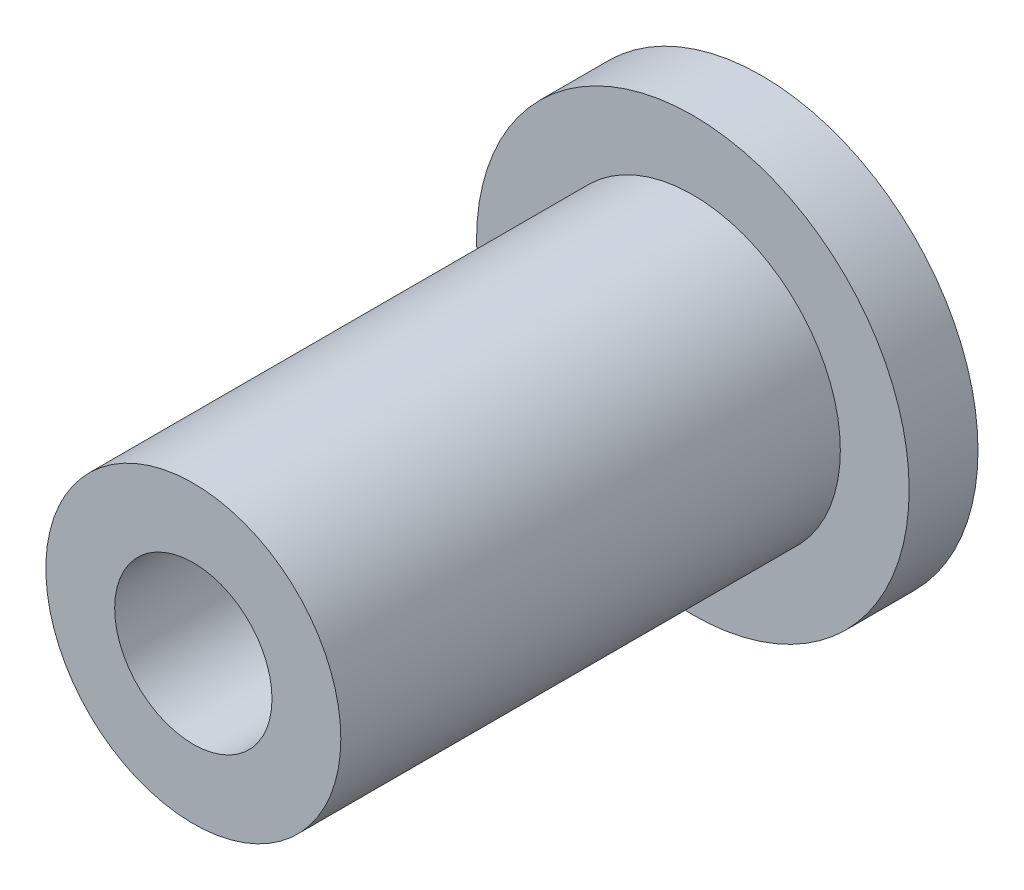
ISO-10303-21;
HEADER;
FILE_DESCRIPTION(('STEP AP214'),'2;1');
FILE_NAME('part.step','',(''),(''),'','','');
FILE_SCHEMA(('AUTOMOTIVE_DESIGN { 1 0 10303 214 1 1 1 1 }'));
ENDSEC;
DATA;
#1=APPLICATION_CONTEXT('core data for automotive mechanical design processes');
#2=APPLICATION_PROTOCOL_DEFINITION('international standard','automotive_design',2000,#1);
#3=PRODUCT_CONTEXT('',#1,'mechanical');
#4=PRODUCT('Part','Part','',(#3));
#5=PRODUCT_RELATED_PRODUCT_CATEGORY('part','',(#4));
#6=PRODUCT_DEFINITION_FORMATION('','',#4);
#7=PRODUCT_DEFINITION_CONTEXT('part definition',#1,'design');
#8=PRODUCT_DEFINITION('design','',#6,#7);
#9=PRODUCT_DEFINITION_SHAPE('','',#8);
#10=(LENGTH_UNIT() NAMED_UNIT(*) SI_UNIT(.MILLI.,.METRE.));
#11=(NAMED_UNIT(*) PLANE_ANGLE_UNIT() SI_UNIT($,.RADIAN.));
#12=(NAMED_UNIT(*) SI_UNIT($,.STERADIAN.) SOLID_ANGLE_UNIT());
#13=UNCERTAINTY_MEASURE_WITH_UNIT(LENGTH_MEASURE(1.E-05),#10,'distance_accuracy_value','');
#14=(GEOMETRIC_REPRESENTATION_CONTEXT(3) GLOBAL_UNCERTAINTY_ASSIGNED_CONTEXT((#13)) GLOBAL_UNIT_ASSIGNED_CONTEXT((#10,
#11,#12)) REPRESENTATION_CONTEXT('',''));
#15=CARTESIAN_POINT('',(0.,0.,0.));
#16=DIRECTION('',(0.,0.,1.));
#17=DIRECTION('',(1.,0.,0.));
#18=AXIS2_PLACEMENT_3D('',#15,#16,#17);
#19=CARTESIAN_POINT('',(0.,0.,12.7));
#20=DIRECTION('',(0.,0.,1.));
#21=DIRECTION('',(1.,0.,0.));
#22=AXIS2_PLACEMENT_3D('',#19,#20,#21);
#23=PLANE('',#22);
#24=CARTESIAN_POINT('',(0.,0.,12.7));
#25=DIRECTION('',(0.,0.,1.));
#26=DIRECTION('',(1.,0.,0.));
#27=AXIS2_PLACEMENT_3D('',#24,#25,#26);
#28=CIRCLE('',#27,7.5);
#29=CARTESIAN_POINT('',(7.5,0.,12.7));
#30=VERTEX_POINT('',#29);
#31=EDGE_CURVE('E10',#30,#30,#28,.T.);
#32=ORIENTED_EDGE('',*,*,#31,.T.);
#33=EDGE_LOOP('',(#32));
#34=FACE_BOUND('',#33,.T.);
#35=CARTESIAN_POINT('',(0.,0.,12.7));
#36=DIRECTION('',(0.,0.,1.));
#37=DIRECTION('',(1.,0.,0.));
#38=AXIS2_PLACEMENT_3D('',#35,#36,#37);
#39=CIRCLE('',#38,4.);
#40=CARTESIAN_POINT('',(4.,0.,12.7));
#41=VERTEX_POINT('',#40);
#42=EDGE_CURVE('E48',#41,#41,#39,.T.);
#43=ORIENTED_EDGE('',*,*,#42,.F.);
#44=EDGE_LOOP('',(#43));
#45=FACE_BOUND('',#44,.T.);
#46=ADVANCED_FACE('F40',(#34,#45),#23,.T.);
#47=CARTESIAN_POINT('',(0.,0.,12.7));
#48=DIRECTION('',(0.,0.,-1.));
#49=DIRECTION('',(-1.,0.,0.));
#50=AXIS2_PLACEMENT_3D('',#47,#48,#49);
#51=CYLINDRICAL_SURFACE('',#50,7.5);
#52=ORIENTED_EDGE('',*,*,#31,.F.);
#53=EDGE_LOOP('',(#52));
#54=FACE_BOUND('',#53,.T.);
#55=CARTESIAN_POINT('',(0.,0.,-12.7));
#56=DIRECTION('',(0.,0.,1.));
#57=DIRECTION('',(1.,0.,0.));
#58=AXIS2_PLACEMENT_3D('',#55,#56,#57);
#59=CIRCLE('',#58,7.5);
#60=CARTESIAN_POINT('',(7.5,0.,-12.7));
#61=VERTEX_POINT('',#60);
#62=EDGE_CURVE('E44',#61,#61,#59,.T.);
#63=ORIENTED_EDGE('',*,*,#62,.T.);
#64=EDGE_LOOP('',(#63));
#65=FACE_BOUND('',#64,.T.);
#66=ADVANCED_FACE('F42',(#54,#65),#51,.T.);
#67=CARTESIAN_POINT('',(0.,0.,12.7));
#68=DIRECTION('',(0.,0.,-1.));
#69=DIRECTION('',(-1.,0.,0.));
#70=AXIS2_PLACEMENT_3D('',#67,#68,#69);
#71=CYLINDRICAL_SURFACE('',#70,4.);
#72=ORIENTED_EDGE('',*,*,#42,.T.);
#73=EDGE_LOOP('',(#72));
#74=FACE_BOUND('',#73,.T.);
#75=CARTESIAN_POINT('',(0.,0.,-16.2));
#76=DIRECTION('',(0.,0.,-1.));
#77=DIRECTION('',(-1.,0.,0.));
#78=AXIS2_PLACEMENT_3D('',#75,#76,#77);
#79=CIRCLE('',#78,4.);
#80=CARTESIAN_POINT('',(-4.,0.,-16.2));
#81=VERTEX_POINT('',#80);
#82=EDGE_CURVE('E60',#81,#81,#79,.T.);
#83=ORIENTED_EDGE('',*,*,#82,.T.);
#84=EDGE_LOOP('',(#83));
#85=FACE_BOUND('',#84,.T.);
#86=ADVANCED_FACE('F64',(#74,#85),#71,.F.);
#87=CARTESIAN_POINT('',(-11.,0.,-12.7));
#88=DIRECTION('',(0.,0.,1.));
#89=DIRECTION('',(1.,0.,0.));
#90=AXIS2_PLACEMENT_3D('',#87,#88,#89);
#91=PLANE('',#90);
#92=ORIENTED_EDGE('',*,*,#62,.F.);
#93=EDGE_LOOP('',(#92));
#94=FACE_BOUND('',#93,.T.);
#95=CARTESIAN_POINT('',(0.,0.,-12.7));
#96=DIRECTION('',(0.,0.,-1.));
#97=DIRECTION('',(-1.,0.,0.));
#98=AXIS2_PLACEMENT_3D('',#95,#96,#97);
#99=CIRCLE('',#98,11.);
#100=CARTESIAN_POINT('',(-11.,0.,-12.7));
#101=VERTEX_POINT('',#100);
#102=EDGE_CURVE('E54',#101,#101,#99,.T.);
#103=ORIENTED_EDGE('',*,*,#102,.F.);
#104=EDGE_LOOP('',(#103));
#105=FACE_BOUND('',#104,.T.);
#106=ADVANCED_FACE('F74',(#94,#105),#91,.T.);
#107=CARTESIAN_POINT('',(0.,0.,-17.1778699373958));
#108=DIRECTION('',(0.,0.,-1.));
#109=DIRECTION('',(-1.,0.,0.));
#110=AXIS2_PLACEMENT_3D('',#107,#108,#109);
#111=CYLINDRICAL_SURFACE('',#110,11.);
#112=ORIENTED_EDGE('',*,*,#102,.T.);
#113=EDGE_LOOP('',(#112));
#114=FACE_BOUND('',#113,.T.);
#115=CARTESIAN_POINT('',(0.,0.,-16.2));
#116=DIRECTION('',(0.,0.,-1.));
#117=DIRECTION('',(-1.,0.,0.));
#118=AXIS2_PLACEMENT_3D('',#115,#116,#117);
#119=CIRCLE('',#118,11.);
#120=CARTESIAN_POINT('',(-11.,0.,-16.2));
#121=VERTEX_POINT('',#120);
#122=EDGE_CURVE('E57',#121,#121,#119,.T.);
#123=ORIENTED_EDGE('',*,*,#122,.F.);
#124=EDGE_LOOP('',(#123));
#125=FACE_BOUND('',#124,.T.);
#126=ADVANCED_FACE('F68',(#114,#125),#111,.T.);
#127=CARTESIAN_POINT('',(-7.5,0.,-16.2));
#128=DIRECTION('',(0.,0.,-1.));
#129=DIRECTION('',(-1.,0.,0.));
#130=AXIS2_PLACEMENT_3D('',#127,#128,#129);
#131=PLANE('',#130);
#132=ORIENTED_EDGE('',*,*,#122,.T.);
#133=EDGE_LOOP('',(#132));
#134=FACE_BOUND('',#133,.T.);
#135=ORIENTED_EDGE('',*,*,#82,.F.);
#136=EDGE_LOOP('',(#135));
#137=FACE_BOUND('',#136,.T.);
#138=ADVANCED_FACE('F66',(#134,#137),#131,.T.);
#139=CLOSED_SHELL('',(#46,#66,#86,#106,#126,#138));
#140=MANIFOLD_SOLID_BREP('B2',#139);
#141=ADVANCED_BREP_SHAPE_REPRESENTATION('',(#18,#140),#14);
#142=SHAPE_DEFINITION_REPRESENTATION(#9,#141);
ENDSEC;
END-ISO-10303-21;
